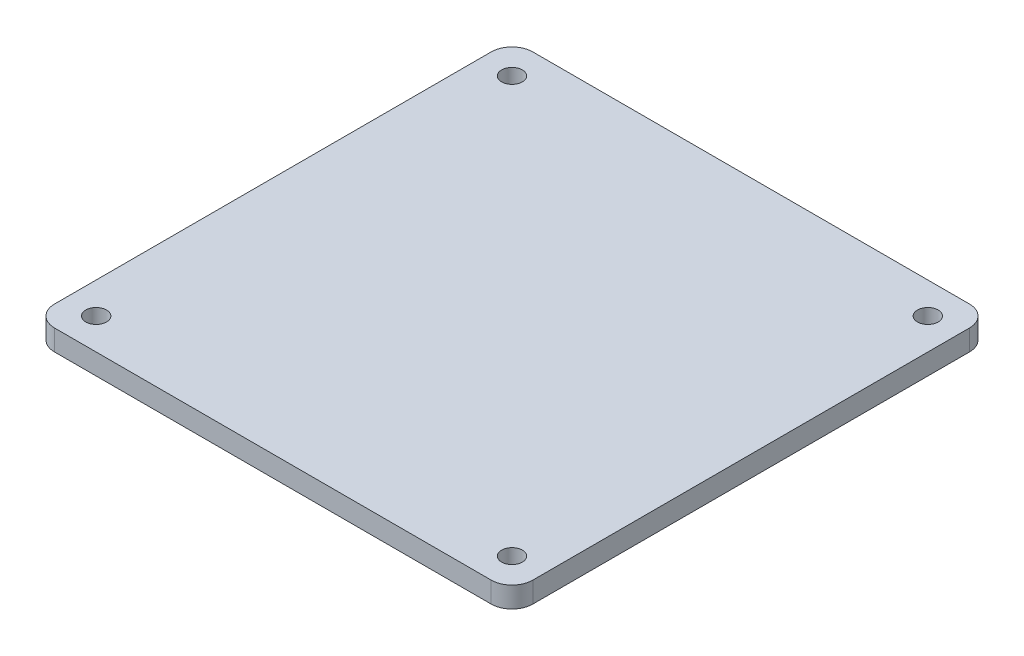
ISO-10303-21;
HEADER;
FILE_DESCRIPTION(('STEP AP214'),'2;1');
FILE_NAME('part.step','',(''),(''),'','','');
FILE_SCHEMA(('AUTOMOTIVE_DESIGN { 1 0 10303 214 1 1 1 1 }'));
ENDSEC;
DATA;
#1=APPLICATION_CONTEXT('core data for automotive mechanical design processes');
#2=APPLICATION_PROTOCOL_DEFINITION('international standard','automotive_design',2000,#1);
#3=PRODUCT_CONTEXT('',#1,'mechanical');
#4=PRODUCT('Part','Part','',(#3));
#5=PRODUCT_RELATED_PRODUCT_CATEGORY('part','',(#4));
#6=PRODUCT_DEFINITION_FORMATION('','',#4);
#7=PRODUCT_DEFINITION_CONTEXT('part definition',#1,'design');
#8=PRODUCT_DEFINITION('design','',#6,#7);
#9=PRODUCT_DEFINITION_SHAPE('','',#8);
#10=(LENGTH_UNIT() NAMED_UNIT(*) SI_UNIT(.MILLI.,.METRE.));
#11=(NAMED_UNIT(*) PLANE_ANGLE_UNIT() SI_UNIT($,.RADIAN.));
#12=(NAMED_UNIT(*) SI_UNIT($,.STERADIAN.) SOLID_ANGLE_UNIT());
#13=UNCERTAINTY_MEASURE_WITH_UNIT(LENGTH_MEASURE(1.E-05),#10,'distance_accuracy_value','');
#14=(GEOMETRIC_REPRESENTATION_CONTEXT(3) GLOBAL_UNCERTAINTY_ASSIGNED_CONTEXT((#13)) GLOBAL_UNIT_ASSIGNED_CONTEXT((#10,
#11,#12)) REPRESENTATION_CONTEXT('',''));
#15=CARTESIAN_POINT('',(0.,0.,0.));
#16=DIRECTION('',(0.,0.,1.));
#17=DIRECTION('',(1.,0.,0.));
#18=AXIS2_PLACEMENT_3D('',#15,#16,#17);
#19=CARTESIAN_POINT('',(21.,2.,-21.));
#20=DIRECTION('',(0.,1.,0.));
#21=DIRECTION('',(0.,0.,1.));
#22=AXIS2_PLACEMENT_3D('',#19,#20,#21);
#23=PLANE('',#22);
#24=CARTESIAN_POINT('',(-20.,2.,20.));
#25=DIRECTION('',(0.,1.,0.));
#26=DIRECTION('',(0.,0.,1.));
#27=AXIS2_PLACEMENT_3D('',#24,#25,#26);
#28=CIRCLE('',#27,1.);
#29=CARTESIAN_POINT('',(-20.,2.,21.));
#30=VERTEX_POINT('',#29);
#31=EDGE_CURVE('E187',#30,#30,#28,.T.);
#32=ORIENTED_EDGE('',*,*,#31,.F.);
#33=EDGE_LOOP('',(#32));
#34=FACE_BOUND('',#33,.T.);
#35=CARTESIAN_POINT('',(-20.,2.,-20.));
#36=DIRECTION('',(0.,1.,0.));
#37=DIRECTION('',(0.,0.,1.));
#38=AXIS2_PLACEMENT_3D('',#35,#36,#37);
#39=CIRCLE('',#38,1.);
#40=CARTESIAN_POINT('',(-20.,2.,-19.));
#41=VERTEX_POINT('',#40);
#42=EDGE_CURVE('E133',#41,#41,#39,.T.);
#43=ORIENTED_EDGE('',*,*,#42,.F.);
#44=EDGE_LOOP('',(#43));
#45=FACE_BOUND('',#44,.T.);
#46=CARTESIAN_POINT('',(21.,2.,-21.));
#47=DIRECTION('',(0.,1.,0.));
#48=DIRECTION('',(0.,0.,1.));
#49=AXIS2_PLACEMENT_3D('',#46,#47,#48);
#50=CIRCLE('',#49,2.);
#51=CARTESIAN_POINT('',(23.,2.,-21.));
#52=VERTEX_POINT('',#51);
#53=CARTESIAN_POINT('',(21.,2.,-23.));
#54=VERTEX_POINT('',#53);
#55=EDGE_CURVE('E144',#52,#54,#50,.T.);
#56=ORIENTED_EDGE('',*,*,#55,.T.);
#57=DIRECTION('',(-1.,0.,0.));
#58=VECTOR('',#57,1.);
#59=CARTESIAN_POINT('',(-21.,2.,-23.));
#60=LINE('',#59,#58);
#61=CARTESIAN_POINT('',(-21.,2.,-23.));
#62=VERTEX_POINT('',#61);
#63=EDGE_CURVE('E92',#54,#62,#60,.T.);
#64=ORIENTED_EDGE('',*,*,#63,.T.);
#65=CARTESIAN_POINT('',(-21.,2.,-21.));
#66=DIRECTION('',(0.,1.,0.));
#67=DIRECTION('',(0.,0.,-1.));
#68=AXIS2_PLACEMENT_3D('',#65,#66,#67);
#69=CIRCLE('',#68,2.);
#70=CARTESIAN_POINT('',(-23.,2.,-21.));
#71=VERTEX_POINT('',#70);
#72=EDGE_CURVE('E159',#62,#71,#69,.T.);
#73=ORIENTED_EDGE('',*,*,#72,.T.);
#74=DIRECTION('',(0.,0.,1.));
#75=VECTOR('',#74,1.);
#76=CARTESIAN_POINT('',(-23.,2.,-21.));
#77=LINE('',#76,#75);
#78=CARTESIAN_POINT('',(-23.,2.,21.));
#79=VERTEX_POINT('',#78);
#80=EDGE_CURVE('E172',#71,#79,#77,.T.);
#81=ORIENTED_EDGE('',*,*,#80,.T.);
#82=CARTESIAN_POINT('',(-21.,2.,21.));
#83=DIRECTION('',(0.,1.,0.));
#84=DIRECTION('',(0.,0.,-1.));
#85=AXIS2_PLACEMENT_3D('',#82,#83,#84);
#86=CIRCLE('',#85,2.);
#87=CARTESIAN_POINT('',(-21.,2.,23.));
#88=VERTEX_POINT('',#87);
#89=EDGE_CURVE('E111',#79,#88,#86,.T.);
#90=ORIENTED_EDGE('',*,*,#89,.T.);
#91=DIRECTION('',(1.,0.,0.));
#92=VECTOR('',#91,1.);
#93=CARTESIAN_POINT('',(-21.,2.,23.));
#94=LINE('',#93,#92);
#95=CARTESIAN_POINT('',(21.,2.,23.));
#96=VERTEX_POINT('',#95);
#97=EDGE_CURVE('E105',#88,#96,#94,.T.);
#98=ORIENTED_EDGE('',*,*,#97,.T.);
#99=CARTESIAN_POINT('',(21.,2.,21.));
#100=DIRECTION('',(0.,1.,0.));
#101=DIRECTION('',(0.,0.,-1.));
#102=AXIS2_PLACEMENT_3D('',#99,#100,#101);
#103=CIRCLE('',#102,2.);
#104=CARTESIAN_POINT('',(23.,2.,21.));
#105=VERTEX_POINT('',#104);
#106=EDGE_CURVE('E109',#96,#105,#103,.T.);
#107=ORIENTED_EDGE('',*,*,#106,.T.);
#108=DIRECTION('',(0.,0.,-1.));
#109=VECTOR('',#108,1.);
#110=CARTESIAN_POINT('',(23.,2.,-21.));
#111=LINE('',#110,#109);
#112=EDGE_CURVE('E49',#105,#52,#111,.T.);
#113=ORIENTED_EDGE('',*,*,#112,.T.);
#114=EDGE_LOOP('',(#56,#64,#73,#81,#90,#98,#107,#113));
#115=FACE_BOUND('',#114,.T.);
#116=CARTESIAN_POINT('',(20.,2.,-20.));
#117=DIRECTION('',(0.,1.,0.));
#118=DIRECTION('',(0.,0.,1.));
#119=AXIS2_PLACEMENT_3D('',#116,#117,#118);
#120=CIRCLE('',#119,1.);
#121=CARTESIAN_POINT('',(20.,2.,-19.));
#122=VERTEX_POINT('',#121);
#123=EDGE_CURVE('E181',#122,#122,#120,.T.);
#124=ORIENTED_EDGE('',*,*,#123,.F.);
#125=EDGE_LOOP('',(#124));
#126=FACE_BOUND('',#125,.T.);
#127=CARTESIAN_POINT('',(20.,2.,20.));
#128=DIRECTION('',(0.,1.,0.));
#129=DIRECTION('',(0.,0.,1.));
#130=AXIS2_PLACEMENT_3D('',#127,#128,#129);
#131=CIRCLE('',#130,0.999999999999998);
#132=CARTESIAN_POINT('',(20.,2.,21.));
#133=VERTEX_POINT('',#132);
#134=EDGE_CURVE('E193',#133,#133,#131,.T.);
#135=ORIENTED_EDGE('',*,*,#134,.F.);
#136=EDGE_LOOP('',(#135));
#137=FACE_BOUND('',#136,.T.);
#138=ADVANCED_FACE('F32',(#34,#45,#115,#126,#137),#23,.T.);
#139=CARTESIAN_POINT('',(21.,0.,-21.));
#140=DIRECTION('',(0.,1.,0.));
#141=DIRECTION('',(0.,0.,1.));
#142=AXIS2_PLACEMENT_3D('',#139,#140,#141);
#143=PLANE('',#142);
#144=CARTESIAN_POINT('',(21.,0.,-21.));
#145=DIRECTION('',(0.,1.,0.));
#146=DIRECTION('',(0.,0.,1.));
#147=AXIS2_PLACEMENT_3D('',#144,#145,#146);
#148=CIRCLE('',#147,2.);
#149=CARTESIAN_POINT('',(23.,0.,-21.));
#150=VERTEX_POINT('',#149);
#151=CARTESIAN_POINT('',(21.,0.,-23.));
#152=VERTEX_POINT('',#151);
#153=EDGE_CURVE('E129',#150,#152,#148,.T.);
#154=ORIENTED_EDGE('',*,*,#153,.F.);
#155=DIRECTION('',(0.,0.,-1.));
#156=VECTOR('',#155,1.);
#157=CARTESIAN_POINT('',(23.,0.,-21.));
#158=LINE('',#157,#156);
#159=CARTESIAN_POINT('',(23.,0.,21.));
#160=VERTEX_POINT('',#159);
#161=EDGE_CURVE('E84',#160,#150,#158,.T.);
#162=ORIENTED_EDGE('',*,*,#161,.F.);
#163=CARTESIAN_POINT('',(21.,0.,21.));
#164=DIRECTION('',(0.,1.,0.));
#165=DIRECTION('',(0.,0.,-1.));
#166=AXIS2_PLACEMENT_3D('',#163,#164,#165);
#167=CIRCLE('',#166,2.);
#168=CARTESIAN_POINT('',(21.,0.,23.));
#169=VERTEX_POINT('',#168);
#170=EDGE_CURVE('E78',#169,#160,#167,.T.);
#171=ORIENTED_EDGE('',*,*,#170,.F.);
#172=DIRECTION('',(1.,0.,0.));
#173=VECTOR('',#172,1.);
#174=CARTESIAN_POINT('',(-21.,0.,23.));
#175=LINE('',#174,#173);
#176=CARTESIAN_POINT('',(-21.,0.,23.));
#177=VERTEX_POINT('',#176);
#178=EDGE_CURVE('E119',#177,#169,#175,.T.);
#179=ORIENTED_EDGE('',*,*,#178,.F.);
#180=CARTESIAN_POINT('',(-21.,0.,21.));
#181=DIRECTION('',(0.,1.,0.));
#182=DIRECTION('',(0.,0.,-1.));
#183=AXIS2_PLACEMENT_3D('',#180,#181,#182);
#184=CIRCLE('',#183,2.);
#185=CARTESIAN_POINT('',(-23.,0.,21.));
#186=VERTEX_POINT('',#185);
#187=EDGE_CURVE('E139',#186,#177,#184,.T.);
#188=ORIENTED_EDGE('',*,*,#187,.F.);
#189=DIRECTION('',(0.,0.,1.));
#190=VECTOR('',#189,1.);
#191=CARTESIAN_POINT('',(-23.,0.,-21.));
#192=LINE('',#191,#190);
#193=CARTESIAN_POINT('',(-23.,0.,-21.));
#194=VERTEX_POINT('',#193);
#195=EDGE_CURVE('E137',#194,#186,#192,.T.);
#196=ORIENTED_EDGE('',*,*,#195,.F.);
#197=CARTESIAN_POINT('',(-21.,0.,-21.));
#198=DIRECTION('',(0.,1.,0.));
#199=DIRECTION('',(0.,0.,-1.));
#200=AXIS2_PLACEMENT_3D('',#197,#198,#199);
#201=CIRCLE('',#200,2.);
#202=CARTESIAN_POINT('',(-21.,0.,-23.));
#203=VERTEX_POINT('',#202);
#204=EDGE_CURVE('E135',#203,#194,#201,.T.);
#205=ORIENTED_EDGE('',*,*,#204,.F.);
#206=DIRECTION('',(-1.,0.,0.));
#207=VECTOR('',#206,1.);
#208=CARTESIAN_POINT('',(-21.,0.,-23.));
#209=LINE('',#208,#207);
#210=EDGE_CURVE('E132',#152,#203,#209,.T.);
#211=ORIENTED_EDGE('',*,*,#210,.F.);
#212=EDGE_LOOP('',(#154,#162,#171,#179,#188,#196,#205,#211));
#213=FACE_BOUND('',#212,.T.);
#214=CARTESIAN_POINT('',(-20.,0.,-20.));
#215=DIRECTION('',(0.,1.,0.));
#216=DIRECTION('',(0.,0.,1.));
#217=AXIS2_PLACEMENT_3D('',#214,#215,#216);
#218=CIRCLE('',#217,1.);
#219=CARTESIAN_POINT('',(-20.,0.,-19.));
#220=VERTEX_POINT('',#219);
#221=EDGE_CURVE('E178',#220,#220,#218,.T.);
#222=ORIENTED_EDGE('',*,*,#221,.T.);
#223=EDGE_LOOP('',(#222));
#224=FACE_BOUND('',#223,.T.);
#225=CARTESIAN_POINT('',(20.,0.,-20.));
#226=DIRECTION('',(0.,1.,0.));
#227=DIRECTION('',(0.,0.,1.));
#228=AXIS2_PLACEMENT_3D('',#225,#226,#227);
#229=CIRCLE('',#228,1.);
#230=CARTESIAN_POINT('',(20.,0.,-19.));
#231=VERTEX_POINT('',#230);
#232=EDGE_CURVE('E184',#231,#231,#229,.T.);
#233=ORIENTED_EDGE('',*,*,#232,.T.);
#234=EDGE_LOOP('',(#233));
#235=FACE_BOUND('',#234,.T.);
#236=CARTESIAN_POINT('',(-20.,0.,20.));
#237=DIRECTION('',(0.,1.,0.));
#238=DIRECTION('',(0.,0.,1.));
#239=AXIS2_PLACEMENT_3D('',#236,#237,#238);
#240=CIRCLE('',#239,1.);
#241=CARTESIAN_POINT('',(-20.,0.,21.));
#242=VERTEX_POINT('',#241);
#243=EDGE_CURVE('E190',#242,#242,#240,.T.);
#244=ORIENTED_EDGE('',*,*,#243,.T.);
#245=EDGE_LOOP('',(#244));
#246=FACE_BOUND('',#245,.T.);
#247=CARTESIAN_POINT('',(20.,0.,20.));
#248=DIRECTION('',(0.,1.,0.));
#249=DIRECTION('',(0.,0.,1.));
#250=AXIS2_PLACEMENT_3D('',#247,#248,#249);
#251=CIRCLE('',#250,0.999999999999998);
#252=CARTESIAN_POINT('',(20.,0.,21.));
#253=VERTEX_POINT('',#252);
#254=EDGE_CURVE('E196',#253,#253,#251,.T.);
#255=ORIENTED_EDGE('',*,*,#254,.T.);
#256=EDGE_LOOP('',(#255));
#257=FACE_BOUND('',#256,.T.);
#258=ADVANCED_FACE('F163',(#213,#224,#235,#246,#257),#143,.F.);
#259=CARTESIAN_POINT('',(21.,2.,-21.));
#260=DIRECTION('',(0.,-1.,0.));
#261=DIRECTION('',(0.,0.,-1.));
#262=AXIS2_PLACEMENT_3D('',#259,#260,#261);
#263=CYLINDRICAL_SURFACE('',#262,2.);
#264=ORIENTED_EDGE('',*,*,#153,.T.);
#265=DIRECTION('',(0.,-1.,0.));
#266=VECTOR('',#265,1.);
#267=CARTESIAN_POINT('',(21.,2.,-23.));
#268=LINE('',#267,#266);
#269=EDGE_CURVE('E11',#54,#152,#268,.T.);
#270=ORIENTED_EDGE('',*,*,#269,.F.);
#271=ORIENTED_EDGE('',*,*,#55,.F.);
#272=DIRECTION('',(0.,-1.,0.));
#273=VECTOR('',#272,1.);
#274=CARTESIAN_POINT('',(23.,2.,-21.));
#275=LINE('',#274,#273);
#276=EDGE_CURVE('E125',#52,#150,#275,.T.);
#277=ORIENTED_EDGE('',*,*,#276,.T.);
#278=EDGE_LOOP('',(#264,#270,#271,#277));
#279=FACE_BOUND('',#278,.T.);
#280=ADVANCED_FACE('F34',(#279),#263,.T.);
#281=CARTESIAN_POINT('',(-21.,2.,-23.));
#282=DIRECTION('',(0.,0.,1.));
#283=DIRECTION('',(1.,0.,0.));
#284=AXIS2_PLACEMENT_3D('',#281,#282,#283);
#285=PLANE('',#284);
#286=ORIENTED_EDGE('',*,*,#210,.T.);
#287=DIRECTION('',(0.,-1.,0.));
#288=VECTOR('',#287,1.);
#289=CARTESIAN_POINT('',(-21.,2.,-23.));
#290=LINE('',#289,#288);
#291=EDGE_CURVE('E41',#62,#203,#290,.T.);
#292=ORIENTED_EDGE('',*,*,#291,.F.);
#293=ORIENTED_EDGE('',*,*,#63,.F.);
#294=ORIENTED_EDGE('',*,*,#269,.T.);
#295=EDGE_LOOP('',(#286,#292,#293,#294));
#296=FACE_BOUND('',#295,.T.);
#297=ADVANCED_FACE('F230',(#296),#285,.F.);
#298=CARTESIAN_POINT('',(-21.,2.,-21.));
#299=DIRECTION('',(0.,-1.,0.));
#300=DIRECTION('',(0.,0.,-1.));
#301=AXIS2_PLACEMENT_3D('',#298,#299,#300);
#302=CYLINDRICAL_SURFACE('',#301,2.);
#303=ORIENTED_EDGE('',*,*,#204,.T.);
#304=DIRECTION('',(0.,-1.,0.));
#305=VECTOR('',#304,1.);
#306=CARTESIAN_POINT('',(-23.,2.,-21.));
#307=LINE('',#306,#305);
#308=EDGE_CURVE('E151',#71,#194,#307,.T.);
#309=ORIENTED_EDGE('',*,*,#308,.F.);
#310=ORIENTED_EDGE('',*,*,#72,.F.);
#311=ORIENTED_EDGE('',*,*,#291,.T.);
#312=EDGE_LOOP('',(#303,#309,#310,#311));
#313=FACE_BOUND('',#312,.T.);
#314=ADVANCED_FACE('F157',(#313),#302,.T.);
#315=CARTESIAN_POINT('',(-23.,2.,-21.));
#316=DIRECTION('',(1.,0.,0.));
#317=DIRECTION('',(0.,0.,-1.));
#318=AXIS2_PLACEMENT_3D('',#315,#316,#317);
#319=PLANE('',#318);
#320=ORIENTED_EDGE('',*,*,#195,.T.);
#321=DIRECTION('',(0.,-1.,0.));
#322=VECTOR('',#321,1.);
#323=CARTESIAN_POINT('',(-23.,2.,21.));
#324=LINE('',#323,#322);
#325=EDGE_CURVE('E148',#79,#186,#324,.T.);
#326=ORIENTED_EDGE('',*,*,#325,.F.);
#327=ORIENTED_EDGE('',*,*,#80,.F.);
#328=ORIENTED_EDGE('',*,*,#308,.T.);
#329=EDGE_LOOP('',(#320,#326,#327,#328));
#330=FACE_BOUND('',#329,.T.);
#331=ADVANCED_FACE('F168',(#330),#319,.F.);
#332=CARTESIAN_POINT('',(-21.,2.,21.));
#333=DIRECTION('',(0.,-1.,0.));
#334=DIRECTION('',(0.,0.,-1.));
#335=AXIS2_PLACEMENT_3D('',#332,#333,#334);
#336=CYLINDRICAL_SURFACE('',#335,2.);
#337=ORIENTED_EDGE('',*,*,#187,.T.);
#338=DIRECTION('',(0.,-1.,0.));
#339=VECTOR('',#338,1.);
#340=CARTESIAN_POINT('',(-21.,2.,23.));
#341=LINE('',#340,#339);
#342=EDGE_CURVE('E120',#88,#177,#341,.T.);
#343=ORIENTED_EDGE('',*,*,#342,.F.);
#344=ORIENTED_EDGE('',*,*,#89,.F.);
#345=ORIENTED_EDGE('',*,*,#325,.T.);
#346=EDGE_LOOP('',(#337,#343,#344,#345));
#347=FACE_BOUND('',#346,.T.);
#348=ADVANCED_FACE('F171',(#347),#336,.T.);
#349=CARTESIAN_POINT('',(-21.,2.,23.));
#350=DIRECTION('',(0.,0.,-1.));
#351=DIRECTION('',(-1.,0.,0.));
#352=AXIS2_PLACEMENT_3D('',#349,#350,#351);
#353=PLANE('',#352);
#354=ORIENTED_EDGE('',*,*,#178,.T.);
#355=DIRECTION('',(0.,-1.,0.));
#356=VECTOR('',#355,1.);
#357=CARTESIAN_POINT('',(21.,2.,23.));
#358=LINE('',#357,#356);
#359=EDGE_CURVE('E116',#96,#169,#358,.T.);
#360=ORIENTED_EDGE('',*,*,#359,.F.);
#361=ORIENTED_EDGE('',*,*,#97,.F.);
#362=ORIENTED_EDGE('',*,*,#342,.T.);
#363=EDGE_LOOP('',(#354,#360,#361,#362));
#364=FACE_BOUND('',#363,.T.);
#365=ADVANCED_FACE('F117',(#364),#353,.F.);
#366=CARTESIAN_POINT('',(21.,2.,21.));
#367=DIRECTION('',(0.,-1.,0.));
#368=DIRECTION('',(0.,0.,-1.));
#369=AXIS2_PLACEMENT_3D('',#366,#367,#368);
#370=CYLINDRICAL_SURFACE('',#369,2.);
#371=ORIENTED_EDGE('',*,*,#170,.T.);
#372=DIRECTION('',(0.,-1.,0.));
#373=VECTOR('',#372,1.);
#374=CARTESIAN_POINT('',(23.,2.,21.));
#375=LINE('',#374,#373);
#376=EDGE_CURVE('E121',#105,#160,#375,.T.);
#377=ORIENTED_EDGE('',*,*,#376,.F.);
#378=ORIENTED_EDGE('',*,*,#106,.F.);
#379=ORIENTED_EDGE('',*,*,#359,.T.);
#380=EDGE_LOOP('',(#371,#377,#378,#379));
#381=FACE_BOUND('',#380,.T.);
#382=ADVANCED_FACE('F123',(#381),#370,.T.);
#383=CARTESIAN_POINT('',(23.,2.,-21.));
#384=DIRECTION('',(-1.,0.,0.));
#385=DIRECTION('',(0.,0.,1.));
#386=AXIS2_PLACEMENT_3D('',#383,#384,#385);
#387=PLANE('',#386);
#388=ORIENTED_EDGE('',*,*,#161,.T.);
#389=ORIENTED_EDGE('',*,*,#276,.F.);
#390=ORIENTED_EDGE('',*,*,#112,.F.);
#391=ORIENTED_EDGE('',*,*,#376,.T.);
#392=EDGE_LOOP('',(#388,#389,#390,#391));
#393=FACE_BOUND('',#392,.T.);
#394=ADVANCED_FACE('F218',(#393),#387,.F.);
#395=CARTESIAN_POINT('',(-20.,2.,-20.));
#396=DIRECTION('',(0.,-1.,0.));
#397=DIRECTION('',(0.,0.,-1.));
#398=AXIS2_PLACEMENT_3D('',#395,#396,#397);
#399=CYLINDRICAL_SURFACE('',#398,1.);
#400=ORIENTED_EDGE('',*,*,#42,.T.);
#401=EDGE_LOOP('',(#400));
#402=FACE_BOUND('',#401,.T.);
#403=ORIENTED_EDGE('',*,*,#221,.F.);
#404=EDGE_LOOP('',(#403));
#405=FACE_BOUND('',#404,.T.);
#406=ADVANCED_FACE('F215',(#402,#405),#399,.F.);
#407=CARTESIAN_POINT('',(20.,2.,-20.));
#408=DIRECTION('',(0.,-1.,0.));
#409=DIRECTION('',(0.,0.,-1.));
#410=AXIS2_PLACEMENT_3D('',#407,#408,#409);
#411=CYLINDRICAL_SURFACE('',#410,1.);
#412=ORIENTED_EDGE('',*,*,#123,.T.);
#413=EDGE_LOOP('',(#412));
#414=FACE_BOUND('',#413,.T.);
#415=ORIENTED_EDGE('',*,*,#232,.F.);
#416=EDGE_LOOP('',(#415));
#417=FACE_BOUND('',#416,.T.);
#418=ADVANCED_FACE('F294',(#414,#417),#411,.F.);
#419=CARTESIAN_POINT('',(-20.,2.,20.));
#420=DIRECTION('',(0.,-1.,0.));
#421=DIRECTION('',(0.,0.,-1.));
#422=AXIS2_PLACEMENT_3D('',#419,#420,#421);
#423=CYLINDRICAL_SURFACE('',#422,1.);
#424=ORIENTED_EDGE('',*,*,#31,.T.);
#425=EDGE_LOOP('',(#424));
#426=FACE_BOUND('',#425,.T.);
#427=ORIENTED_EDGE('',*,*,#243,.F.);
#428=EDGE_LOOP('',(#427));
#429=FACE_BOUND('',#428,.T.);
#430=ADVANCED_FACE('F302',(#426,#429),#423,.F.);
#431=CARTESIAN_POINT('',(20.,2.,20.));
#432=DIRECTION('',(0.,-1.,0.));
#433=DIRECTION('',(0.,0.,-1.));
#434=AXIS2_PLACEMENT_3D('',#431,#432,#433);
#435=CYLINDRICAL_SURFACE('',#434,0.999999999999998);
#436=ORIENTED_EDGE('',*,*,#134,.T.);
#437=EDGE_LOOP('',(#436));
#438=FACE_BOUND('',#437,.T.);
#439=ORIENTED_EDGE('',*,*,#254,.F.);
#440=EDGE_LOOP('',(#439));
#441=FACE_BOUND('',#440,.T.);
#442=ADVANCED_FACE('F202',(#438,#441),#435,.F.);
#443=CLOSED_SHELL('',(#138,#258,#280,#297,#314,#331,#348,#365,#382,#394,#406,#418,#430,#442));
#444=MANIFOLD_SOLID_BREP('B2',#443);
#445=ADVANCED_BREP_SHAPE_REPRESENTATION('',(#18,#444),#14);
#446=SHAPE_DEFINITION_REPRESENTATION(#9,#445);
ENDSEC;
END-ISO-10303-21;
